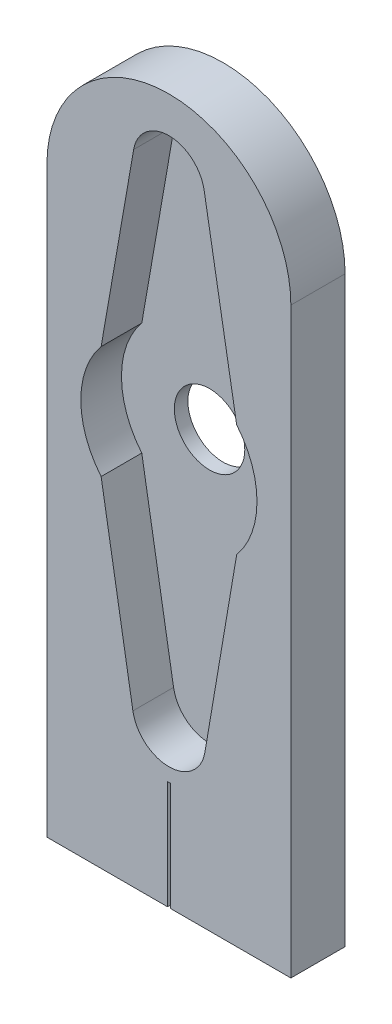
ISO-10303-21;
HEADER;
FILE_DESCRIPTION(('STEP AP214'),'2;1');
FILE_NAME('part.step','',(''),(''),'','','');
FILE_SCHEMA(('AUTOMOTIVE_DESIGN { 1 0 10303 214 1 1 1 1 }'));
ENDSEC;
DATA;
#1=APPLICATION_CONTEXT('core data for automotive mechanical design processes');
#2=APPLICATION_PROTOCOL_DEFINITION('international standard','automotive_design',2000,#1);
#3=PRODUCT_CONTEXT('',#1,'mechanical');
#4=PRODUCT('Part','Part','',(#3));
#5=PRODUCT_RELATED_PRODUCT_CATEGORY('part','',(#4));
#6=PRODUCT_DEFINITION_FORMATION('','',#4);
#7=PRODUCT_DEFINITION_CONTEXT('part definition',#1,'design');
#8=PRODUCT_DEFINITION('design','',#6,#7);
#9=PRODUCT_DEFINITION_SHAPE('','',#8);
#10=(LENGTH_UNIT() NAMED_UNIT(*) SI_UNIT(.MILLI.,.METRE.));
#11=(NAMED_UNIT(*) PLANE_ANGLE_UNIT() SI_UNIT($,.RADIAN.));
#12=(NAMED_UNIT(*) SI_UNIT($,.STERADIAN.) SOLID_ANGLE_UNIT());
#13=UNCERTAINTY_MEASURE_WITH_UNIT(LENGTH_MEASURE(1.E-05),#10,'distance_accuracy_value','');
#14=(GEOMETRIC_REPRESENTATION_CONTEXT(3) GLOBAL_UNCERTAINTY_ASSIGNED_CONTEXT((#13)) GLOBAL_UNIT_ASSIGNED_CONTEXT((#10,
#11,#12)) REPRESENTATION_CONTEXT('',''));
#15=CARTESIAN_POINT('',(0.,0.,0.));
#16=DIRECTION('',(0.,0.,1.));
#17=DIRECTION('',(1.,0.,0.));
#18=AXIS2_PLACEMENT_3D('',#15,#16,#17);
#19=CARTESIAN_POINT('',(-9.,0.,4.));
#20=DIRECTION('',(0.,1.,0.));
#21=DIRECTION('',(0.,0.,1.));
#22=AXIS2_PLACEMENT_3D('',#19,#20,#21);
#23=PLANE('',#22);
#24=DIRECTION('',(0.,0.,-1.));
#25=VECTOR('',#24,1.);
#26=CARTESIAN_POINT('',(0.1,0.,4.));
#27=LINE('',#26,#25);
#28=CARTESIAN_POINT('',(0.1,0.,4.));
#29=VERTEX_POINT('',#28);
#30=CARTESIAN_POINT('',(0.1,0.,0.));
#31=VERTEX_POINT('',#30);
#32=EDGE_CURVE('E154',#29,#31,#27,.T.);
#33=ORIENTED_EDGE('',*,*,#32,.T.);
#34=DIRECTION('',(1.,0.,0.));
#35=VECTOR('',#34,1.);
#36=CARTESIAN_POINT('',(-9.,0.,0.));
#37=LINE('',#36,#35);
#38=CARTESIAN_POINT('',(9.,0.,0.));
#39=VERTEX_POINT('',#38);
#40=EDGE_CURVE('E210',#31,#39,#37,.T.);
#41=ORIENTED_EDGE('',*,*,#40,.T.);
#42=DIRECTION('',(0.,0.,-1.));
#43=VECTOR('',#42,1.);
#44=CARTESIAN_POINT('',(9.,0.,4.));
#45=LINE('',#44,#43);
#46=CARTESIAN_POINT('',(9.,0.,4.));
#47=VERTEX_POINT('',#46);
#48=EDGE_CURVE('E11',#47,#39,#45,.T.);
#49=ORIENTED_EDGE('',*,*,#48,.F.);
#50=DIRECTION('',(1.,0.,0.));
#51=VECTOR('',#50,1.);
#52=CARTESIAN_POINT('',(-9.,0.,4.));
#53=LINE('',#52,#51);
#54=EDGE_CURVE('E170',#29,#47,#53,.T.);
#55=ORIENTED_EDGE('',*,*,#54,.F.);
#56=EDGE_LOOP('',(#33,#41,#49,#55));
#57=FACE_BOUND('',#56,.T.);
#58=ADVANCED_FACE('F38',(#57),#23,.F.);
#59=CARTESIAN_POINT('',(0.,43.,4.));
#60=DIRECTION('',(0.,0.,-1.));
#61=DIRECTION('',(-1.,0.,0.));
#62=AXIS2_PLACEMENT_3D('',#59,#60,#61);
#63=PLANE('',#62);
#64=DIRECTION('',(0.171428571428572,-0.98519655140381,0.));
#65=VECTOR('',#64,1.);
#66=CARTESIAN_POINT('',(2.6,47.145110573231,4.));
#67=LINE('',#66,#65);
#68=CARTESIAN_POINT('',(2.6,47.145110573231,4.));
#69=VERTEX_POINT('',#68);
#70=CARTESIAN_POINT('',(5.,33.3523588535777,4.));
#71=VERTEX_POINT('',#70);
#72=EDGE_CURVE('E290',#69,#71,#67,.T.);
#73=ORIENTED_EDGE('',*,*,#72,.T.);
#74=CARTESIAN_POINT('',(0.,29.1990469221187,4.));
#75=DIRECTION('',(0.,0.,1.));
#76=DIRECTION('',(1.,0.,0.));
#77=AXIS2_PLACEMENT_3D('',#74,#75,#76);
#78=CIRCLE('',#77,6.5);
#79=CARTESIAN_POINT('',(5.,25.0457349906596,4.));
#80=VERTEX_POINT('',#79);
#81=EDGE_CURVE('E63',#80,#71,#78,.T.);
#82=ORIENTED_EDGE('',*,*,#81,.F.);
#83=DIRECTION('',(-0.167405247280844,-0.985888169714415,0.));
#84=VECTOR('',#83,1.);
#85=CARTESIAN_POINT('',(5.,25.0457349906596,4.));
#86=LINE('',#85,#84);
#87=CARTESIAN_POINT('',(2.65632653806819,11.2433006146578,4.));
#88=VERTEX_POINT('',#87);
#89=EDGE_CURVE('E262',#80,#88,#86,.T.);
#90=ORIENTED_EDGE('',*,*,#89,.T.);
#91=CARTESIAN_POINT('',(0.,11.6943487300772,4.));
#92=DIRECTION('',(0.,0.,1.));
#93=DIRECTION('',(1.,0.,0.));
#94=AXIS2_PLACEMENT_3D('',#91,#92,#93);
#95=CIRCLE('',#94,2.69434873007722);
#96=CARTESIAN_POINT('',(-2.65632653806819,11.2433006146578,4.));
#97=VERTEX_POINT('',#96);
#98=EDGE_CURVE('E310',#97,#88,#95,.T.);
#99=ORIENTED_EDGE('',*,*,#98,.F.);
#100=DIRECTION('',(0.167405247280844,-0.985888169714415,0.));
#101=VECTOR('',#100,1.);
#102=CARTESIAN_POINT('',(-5.,25.0457349906596,4.));
#103=LINE('',#102,#101);
#104=CARTESIAN_POINT('',(-5.,25.0457349906596,4.));
#105=VERTEX_POINT('',#104);
#106=EDGE_CURVE('E306',#105,#97,#103,.T.);
#107=ORIENTED_EDGE('',*,*,#106,.F.);
#108=CARTESIAN_POINT('',(0.,29.1990469221187,4.));
#109=DIRECTION('',(0.,0.,1.));
#110=DIRECTION('',(1.,0.,0.));
#111=AXIS2_PLACEMENT_3D('',#108,#109,#110);
#112=CIRCLE('',#111,6.5);
#113=CARTESIAN_POINT('',(-5.,33.3523588535777,4.));
#114=VERTEX_POINT('',#113);
#115=EDGE_CURVE('E302',#114,#105,#112,.T.);
#116=ORIENTED_EDGE('',*,*,#115,.F.);
#117=DIRECTION('',(-0.171428571428572,-0.98519655140381,0.));
#118=VECTOR('',#117,1.);
#119=CARTESIAN_POINT('',(-2.6,47.145110573231,4.));
#120=LINE('',#119,#118);
#121=CARTESIAN_POINT('',(-2.6,47.145110573231,4.));
#122=VERTEX_POINT('',#121);
#123=EDGE_CURVE('E298',#122,#114,#120,.T.);
#124=ORIENTED_EDGE('',*,*,#123,.F.);
#125=CARTESIAN_POINT('',(0.,46.6926990365898,4.));
#126=DIRECTION('',(0.,0.,1.));
#127=DIRECTION('',(1.,0.,0.));
#128=AXIS2_PLACEMENT_3D('',#125,#126,#127);
#129=CIRCLE('',#128,2.63906729707413);
#130=EDGE_CURVE('E294',#69,#122,#129,.T.);
#131=ORIENTED_EDGE('',*,*,#130,.F.);
#132=EDGE_LOOP('',(#73,#82,#90,#99,#107,#116,#124,#131));
#133=FACE_BOUND('',#132,.T.);
#134=DIRECTION('',(0.,1.,0.));
#135=VECTOR('',#134,1.);
#136=CARTESIAN_POINT('',(0.1,0.,4.));
#137=LINE('',#136,#135);
#138=CARTESIAN_POINT('',(0.1,8.,4.));
#139=VERTEX_POINT('',#138);
#140=EDGE_CURVE('E157',#29,#139,#137,.T.);
#141=ORIENTED_EDGE('',*,*,#140,.F.);
#142=ORIENTED_EDGE('',*,*,#54,.T.);
#143=DIRECTION('',(0.,1.,0.));
#144=VECTOR('',#143,1.);
#145=CARTESIAN_POINT('',(9.,0.,4.));
#146=LINE('',#145,#144);
#147=CARTESIAN_POINT('',(8.99999999999999,43.,4.));
#148=VERTEX_POINT('',#147);
#149=EDGE_CURVE('E186',#47,#148,#146,.T.);
#150=ORIENTED_EDGE('',*,*,#149,.T.);
#151=CARTESIAN_POINT('',(0.,43.,4.));
#152=DIRECTION('',(0.,0.,-1.));
#153=DIRECTION('',(-1.,0.,0.));
#154=AXIS2_PLACEMENT_3D('',#151,#152,#153);
#155=CIRCLE('',#154,8.99999999999999);
#156=CARTESIAN_POINT('',(-8.99999999999999,43.,4.));
#157=VERTEX_POINT('',#156);
#158=EDGE_CURVE('E196',#157,#148,#155,.T.);
#159=ORIENTED_EDGE('',*,*,#158,.F.);
#160=DIRECTION('',(0.,1.,0.));
#161=VECTOR('',#160,1.);
#162=CARTESIAN_POINT('',(-9.,0.,4.));
#163=LINE('',#162,#161);
#164=CARTESIAN_POINT('',(-9.,0.,4.));
#165=VERTEX_POINT('',#164);
#166=EDGE_CURVE('E200',#165,#157,#163,.T.);
#167=ORIENTED_EDGE('',*,*,#166,.F.);
#168=CARTESIAN_POINT('',(-0.1,0.,4.));
#169=VERTEX_POINT('',#168);
#170=EDGE_CURVE('E180',#165,#169,#53,.T.);
#171=ORIENTED_EDGE('',*,*,#170,.T.);
#172=DIRECTION('',(0.,1.,0.));
#173=VECTOR('',#172,1.);
#174=CARTESIAN_POINT('',(-0.1,0.,4.));
#175=LINE('',#174,#173);
#176=CARTESIAN_POINT('',(-0.1,8.,4.));
#177=VERTEX_POINT('',#176);
#178=EDGE_CURVE('E239',#169,#177,#175,.T.);
#179=ORIENTED_EDGE('',*,*,#178,.T.);
#180=DIRECTION('',(1.,0.,0.));
#181=VECTOR('',#180,1.);
#182=CARTESIAN_POINT('',(-0.1,8.,4.));
#183=LINE('',#182,#181);
#184=EDGE_CURVE('E174',#177,#139,#183,.T.);
#185=ORIENTED_EDGE('',*,*,#184,.T.);
#186=EDGE_LOOP('',(#141,#142,#150,#159,#167,#171,#179,#185));
#187=FACE_BOUND('',#186,.T.);
#188=ADVANCED_FACE('F169',(#133,#187),#63,.F.);
#189=CARTESIAN_POINT('',(0.,43.,0.));
#190=DIRECTION('',(0.,0.,-1.));
#191=DIRECTION('',(-1.,0.,0.));
#192=AXIS2_PLACEMENT_3D('',#189,#190,#191);
#193=PLANE('',#192);
#194=CARTESIAN_POINT('',(0.,29.0651564973815,0.));
#195=DIRECTION('',(0.,0.,-1.));
#196=DIRECTION('',(-1.,0.,0.));
#197=AXIS2_PLACEMENT_3D('',#194,#195,#196);
#198=CIRCLE('',#197,2.6);
#199=CARTESIAN_POINT('',(-2.6,29.0651564973815,0.));
#200=VERTEX_POINT('',#199);
#201=EDGE_CURVE('E253',#200,#200,#198,.F.);
#202=ORIENTED_EDGE('',*,*,#201,.T.);
#203=EDGE_LOOP('',(#202));
#204=FACE_BOUND('',#203,.T.);
#205=ORIENTED_EDGE('',*,*,#40,.F.);
#206=DIRECTION('',(0.,1.,0.));
#207=VECTOR('',#206,1.);
#208=CARTESIAN_POINT('',(0.1,0.,0.));
#209=LINE('',#208,#207);
#210=CARTESIAN_POINT('',(0.1,8.,0.));
#211=VERTEX_POINT('',#210);
#212=EDGE_CURVE('E160',#31,#211,#209,.T.);
#213=ORIENTED_EDGE('',*,*,#212,.T.);
#214=DIRECTION('',(1.,0.,0.));
#215=VECTOR('',#214,1.);
#216=CARTESIAN_POINT('',(-0.1,8.,0.));
#217=LINE('',#216,#215);
#218=CARTESIAN_POINT('',(-0.1,8.,0.));
#219=VERTEX_POINT('',#218);
#220=EDGE_CURVE('E524',#219,#211,#217,.T.);
#221=ORIENTED_EDGE('',*,*,#220,.F.);
#222=DIRECTION('',(0.,1.,0.));
#223=VECTOR('',#222,1.);
#224=CARTESIAN_POINT('',(-0.1,0.,0.));
#225=LINE('',#224,#223);
#226=CARTESIAN_POINT('',(-0.0999999999999994,0.,0.));
#227=VERTEX_POINT('',#226);
#228=EDGE_CURVE('E176',#227,#219,#225,.T.);
#229=ORIENTED_EDGE('',*,*,#228,.F.);
#230=CARTESIAN_POINT('',(-9.,0.,0.));
#231=VERTEX_POINT('',#230);
#232=EDGE_CURVE('E205',#231,#227,#37,.T.);
#233=ORIENTED_EDGE('',*,*,#232,.F.);
#234=DIRECTION('',(0.,1.,0.));
#235=VECTOR('',#234,1.);
#236=CARTESIAN_POINT('',(-9.,0.,0.));
#237=LINE('',#236,#235);
#238=CARTESIAN_POINT('',(-8.99999999999999,43.,0.));
#239=VERTEX_POINT('',#238);
#240=EDGE_CURVE('E181',#231,#239,#237,.T.);
#241=ORIENTED_EDGE('',*,*,#240,.T.);
#242=CARTESIAN_POINT('',(0.,43.,0.));
#243=DIRECTION('',(0.,0.,-1.));
#244=DIRECTION('',(-1.,0.,0.));
#245=AXIS2_PLACEMENT_3D('',#242,#243,#244);
#246=CIRCLE('',#245,8.99999999999999);
#247=CARTESIAN_POINT('',(8.99999999999999,43.,0.));
#248=VERTEX_POINT('',#247);
#249=EDGE_CURVE('E188',#239,#248,#246,.T.);
#250=ORIENTED_EDGE('',*,*,#249,.T.);
#251=DIRECTION('',(0.,1.,0.));
#252=VECTOR('',#251,1.);
#253=CARTESIAN_POINT('',(9.,0.,0.));
#254=LINE('',#253,#252);
#255=EDGE_CURVE('E209',#39,#248,#254,.T.);
#256=ORIENTED_EDGE('',*,*,#255,.F.);
#257=EDGE_LOOP('',(#205,#213,#221,#229,#233,#241,#250,#256));
#258=FACE_BOUND('',#257,.T.);
#259=ADVANCED_FACE('F232',(#204,#258),#193,.T.);
#260=ORIENTED_EDGE('',*,*,#232,.T.);
#261=DIRECTION('',(0.,0.,-1.));
#262=VECTOR('',#261,1.);
#263=CARTESIAN_POINT('',(-0.1,0.,4.));
#264=LINE('',#263,#262);
#265=EDGE_CURVE('E55',#169,#227,#264,.T.);
#266=ORIENTED_EDGE('',*,*,#265,.F.);
#267=ORIENTED_EDGE('',*,*,#170,.F.);
#268=DIRECTION('',(0.,0.,-1.));
#269=VECTOR('',#268,1.);
#270=CARTESIAN_POINT('',(-9.,0.,4.));
#271=LINE('',#270,#269);
#272=EDGE_CURVE('E204',#165,#231,#271,.T.);
#273=ORIENTED_EDGE('',*,*,#272,.T.);
#274=EDGE_LOOP('',(#260,#266,#267,#273));
#275=FACE_BOUND('',#274,.T.);
#276=ADVANCED_FACE('F40',(#275),#23,.F.);
#277=CARTESIAN_POINT('',(9.,0.,4.));
#278=DIRECTION('',(-1.,0.,0.));
#279=DIRECTION('',(0.,-1.,0.));
#280=AXIS2_PLACEMENT_3D('',#277,#278,#279);
#281=PLANE('',#280);
#282=ORIENTED_EDGE('',*,*,#255,.T.);
#283=DIRECTION('',(0.,0.,-1.));
#284=VECTOR('',#283,1.);
#285=CARTESIAN_POINT('',(8.99999999999999,43.,4.));
#286=LINE('',#285,#284);
#287=EDGE_CURVE('E48',#148,#248,#286,.T.);
#288=ORIENTED_EDGE('',*,*,#287,.F.);
#289=ORIENTED_EDGE('',*,*,#149,.F.);
#290=ORIENTED_EDGE('',*,*,#48,.T.);
#291=EDGE_LOOP('',(#282,#288,#289,#290));
#292=FACE_BOUND('',#291,.T.);
#293=ADVANCED_FACE('F230',(#292),#281,.F.);
#294=CARTESIAN_POINT('',(0.,43.,4.));
#295=DIRECTION('',(0.,0.,-1.));
#296=DIRECTION('',(-1.,0.,0.));
#297=AXIS2_PLACEMENT_3D('',#294,#295,#296);
#298=CYLINDRICAL_SURFACE('',#297,8.99999999999999);
#299=ORIENTED_EDGE('',*,*,#249,.F.);
#300=DIRECTION('',(0.,0.,-1.));
#301=VECTOR('',#300,1.);
#302=CARTESIAN_POINT('',(-8.99999999999999,43.,4.));
#303=LINE('',#302,#301);
#304=EDGE_CURVE('E219',#157,#239,#303,.T.);
#305=ORIENTED_EDGE('',*,*,#304,.F.);
#306=ORIENTED_EDGE('',*,*,#158,.T.);
#307=ORIENTED_EDGE('',*,*,#287,.T.);
#308=EDGE_LOOP('',(#299,#305,#306,#307));
#309=FACE_BOUND('',#308,.T.);
#310=ADVANCED_FACE('F226',(#309),#298,.T.);
#311=CARTESIAN_POINT('',(-9.,0.,4.));
#312=DIRECTION('',(-1.,0.,0.));
#313=DIRECTION('',(0.,-1.,0.));
#314=AXIS2_PLACEMENT_3D('',#311,#312,#313);
#315=PLANE('',#314);
#316=ORIENTED_EDGE('',*,*,#240,.F.);
#317=ORIENTED_EDGE('',*,*,#272,.F.);
#318=ORIENTED_EDGE('',*,*,#166,.T.);
#319=ORIENTED_EDGE('',*,*,#304,.T.);
#320=EDGE_LOOP('',(#316,#317,#318,#319));
#321=FACE_BOUND('',#320,.T.);
#322=ADVANCED_FACE('F236',(#321),#315,.T.);
#323=CARTESIAN_POINT('',(0.,29.1990469221187,1.));
#324=DIRECTION('',(0.,0.,1.));
#325=DIRECTION('',(1.,0.,0.));
#326=AXIS2_PLACEMENT_3D('',#323,#324,#325);
#327=CYLINDRICAL_SURFACE('',#326,6.5);
#328=ORIENTED_EDGE('',*,*,#81,.T.);
#329=DIRECTION('',(0.,0.,1.));
#330=VECTOR('',#329,1.);
#331=CARTESIAN_POINT('',(5.,33.3523588535777,1.));
#332=LINE('',#331,#330);
#333=CARTESIAN_POINT('',(5.,33.3523588535777,1.));
#334=VERTEX_POINT('',#333);
#335=EDGE_CURVE('E192',#334,#71,#332,.T.);
#336=ORIENTED_EDGE('',*,*,#335,.F.);
#337=CARTESIAN_POINT('',(0.,29.1990469221187,1.));
#338=DIRECTION('',(0.,0.,1.));
#339=DIRECTION('',(1.,0.,0.));
#340=AXIS2_PLACEMENT_3D('',#337,#338,#339);
#341=CIRCLE('',#340,6.5);
#342=CARTESIAN_POINT('',(5.,25.0457349906596,1.));
#343=VERTEX_POINT('',#342);
#344=EDGE_CURVE('E257',#343,#334,#341,.T.);
#345=ORIENTED_EDGE('',*,*,#344,.F.);
#346=DIRECTION('',(0.,0.,1.));
#347=VECTOR('',#346,1.);
#348=CARTESIAN_POINT('',(5.,25.0457349906596,1.));
#349=LINE('',#348,#347);
#350=EDGE_CURVE('E317',#343,#80,#349,.T.);
#351=ORIENTED_EDGE('',*,*,#350,.T.);
#352=EDGE_LOOP('',(#328,#336,#345,#351));
#353=FACE_BOUND('',#352,.T.);
#354=ADVANCED_FACE('F356',(#353),#327,.F.);
#355=CARTESIAN_POINT('',(5.,25.0457349906596,1.));
#356=DIRECTION('',(-0.985888169714415,0.167405247280844,0.));
#357=DIRECTION('',(-0.167405247280844,-0.985888169714415,0.));
#358=AXIS2_PLACEMENT_3D('',#355,#356,#357);
#359=PLANE('',#358);
#360=ORIENTED_EDGE('',*,*,#89,.F.);
#361=ORIENTED_EDGE('',*,*,#350,.F.);
#362=DIRECTION('',(-0.167405247280844,-0.985888169714415,0.));
#363=VECTOR('',#362,1.);
#364=CARTESIAN_POINT('',(5.,25.0457349906596,1.));
#365=LINE('',#364,#363);
#366=CARTESIAN_POINT('',(2.65632653806819,11.2433006146578,1.));
#367=VERTEX_POINT('',#366);
#368=EDGE_CURVE('E285',#343,#367,#365,.T.);
#369=ORIENTED_EDGE('',*,*,#368,.T.);
#370=DIRECTION('',(0.,0.,1.));
#371=VECTOR('',#370,1.);
#372=CARTESIAN_POINT('',(2.65632653806819,11.2433006146578,1.));
#373=LINE('',#372,#371);
#374=EDGE_CURVE('E320',#367,#88,#373,.T.);
#375=ORIENTED_EDGE('',*,*,#374,.T.);
#376=EDGE_LOOP('',(#360,#361,#369,#375));
#377=FACE_BOUND('',#376,.T.);
#378=ADVANCED_FACE('F359',(#377),#359,.T.);
#379=CARTESIAN_POINT('',(0.,11.6943487300772,1.));
#380=DIRECTION('',(0.,0.,1.));
#381=DIRECTION('',(1.,0.,0.));
#382=AXIS2_PLACEMENT_3D('',#379,#380,#381);
#383=CYLINDRICAL_SURFACE('',#382,2.69434873007722);
#384=ORIENTED_EDGE('',*,*,#98,.T.);
#385=ORIENTED_EDGE('',*,*,#374,.F.);
#386=CARTESIAN_POINT('',(0.,11.6943487300772,1.));
#387=DIRECTION('',(0.,0.,1.));
#388=DIRECTION('',(1.,0.,0.));
#389=AXIS2_PLACEMENT_3D('',#386,#387,#388);
#390=CIRCLE('',#389,2.69434873007722);
#391=CARTESIAN_POINT('',(-2.65632653806819,11.2433006146578,1.));
#392=VERTEX_POINT('',#391);
#393=EDGE_CURVE('E281',#392,#367,#390,.T.);
#394=ORIENTED_EDGE('',*,*,#393,.F.);
#395=DIRECTION('',(0.,0.,1.));
#396=VECTOR('',#395,1.);
#397=CARTESIAN_POINT('',(-2.65632653806819,11.2433006146578,1.));
#398=LINE('',#397,#396);
#399=EDGE_CURVE('E323',#392,#97,#398,.T.);
#400=ORIENTED_EDGE('',*,*,#399,.T.);
#401=EDGE_LOOP('',(#384,#385,#394,#400));
#402=FACE_BOUND('',#401,.T.);
#403=ADVANCED_FACE('F364',(#402),#383,.F.);
#404=CARTESIAN_POINT('',(-5.,25.0457349906596,1.));
#405=DIRECTION('',(-0.985888169714415,-0.167405247280844,0.));
#406=DIRECTION('',(0.167405247280844,-0.985888169714415,0.));
#407=AXIS2_PLACEMENT_3D('',#404,#405,#406);
#408=PLANE('',#407);
#409=ORIENTED_EDGE('',*,*,#106,.T.);
#410=ORIENTED_EDGE('',*,*,#399,.F.);
#411=DIRECTION('',(0.167405247280844,-0.985888169714415,0.));
#412=VECTOR('',#411,1.);
#413=CARTESIAN_POINT('',(-5.,25.0457349906596,1.));
#414=LINE('',#413,#412);
#415=CARTESIAN_POINT('',(-5.,25.0457349906596,1.));
#416=VERTEX_POINT('',#415);
#417=EDGE_CURVE('E277',#416,#392,#414,.T.);
#418=ORIENTED_EDGE('',*,*,#417,.F.);
#419=DIRECTION('',(0.,0.,1.));
#420=VECTOR('',#419,1.);
#421=CARTESIAN_POINT('',(-5.,25.0457349906596,1.));
#422=LINE('',#421,#420);
#423=EDGE_CURVE('E326',#416,#105,#422,.T.);
#424=ORIENTED_EDGE('',*,*,#423,.T.);
#425=EDGE_LOOP('',(#409,#410,#418,#424));
#426=FACE_BOUND('',#425,.T.);
#427=ADVANCED_FACE('F368',(#426),#408,.F.);
#428=CARTESIAN_POINT('',(0.,29.1990469221187,1.));
#429=DIRECTION('',(0.,0.,1.));
#430=DIRECTION('',(1.,0.,0.));
#431=AXIS2_PLACEMENT_3D('',#428,#429,#430);
#432=CYLINDRICAL_SURFACE('',#431,6.5);
#433=ORIENTED_EDGE('',*,*,#115,.T.);
#434=ORIENTED_EDGE('',*,*,#423,.F.);
#435=CARTESIAN_POINT('',(0.,29.1990469221187,1.));
#436=DIRECTION('',(0.,0.,1.));
#437=DIRECTION('',(1.,0.,0.));
#438=AXIS2_PLACEMENT_3D('',#435,#436,#437);
#439=CIRCLE('',#438,6.5);
#440=CARTESIAN_POINT('',(-5.,33.3523588535777,1.));
#441=VERTEX_POINT('',#440);
#442=EDGE_CURVE('E273',#441,#416,#439,.T.);
#443=ORIENTED_EDGE('',*,*,#442,.F.);
#444=DIRECTION('',(0.,0.,1.));
#445=VECTOR('',#444,1.);
#446=CARTESIAN_POINT('',(-5.,33.3523588535777,1.));
#447=LINE('',#446,#445);
#448=EDGE_CURVE('E329',#441,#114,#447,.T.);
#449=ORIENTED_EDGE('',*,*,#448,.T.);
#450=EDGE_LOOP('',(#433,#434,#443,#449));
#451=FACE_BOUND('',#450,.T.);
#452=ADVANCED_FACE('F370',(#451),#432,.F.);
#453=CARTESIAN_POINT('',(-2.6,47.145110573231,1.));
#454=DIRECTION('',(-0.985196551403809,0.171428571428572,0.));
#455=DIRECTION('',(-0.171428571428572,-0.98519655140381,0.));
#456=AXIS2_PLACEMENT_3D('',#453,#454,#455);
#457=PLANE('',#456);
#458=ORIENTED_EDGE('',*,*,#123,.T.);
#459=ORIENTED_EDGE('',*,*,#448,.F.);
#460=DIRECTION('',(-0.171428571428572,-0.98519655140381,0.));
#461=VECTOR('',#460,1.);
#462=CARTESIAN_POINT('',(-2.6,47.145110573231,1.));
#463=LINE('',#462,#461);
#464=CARTESIAN_POINT('',(-2.6,47.145110573231,1.));
#465=VERTEX_POINT('',#464);
#466=EDGE_CURVE('E269',#465,#441,#463,.T.);
#467=ORIENTED_EDGE('',*,*,#466,.F.);
#468=DIRECTION('',(0.,0.,1.));
#469=VECTOR('',#468,1.);
#470=CARTESIAN_POINT('',(-2.6,47.145110573231,1.));
#471=LINE('',#470,#469);
#472=EDGE_CURVE('E332',#465,#122,#471,.T.);
#473=ORIENTED_EDGE('',*,*,#472,.T.);
#474=EDGE_LOOP('',(#458,#459,#467,#473));
#475=FACE_BOUND('',#474,.T.);
#476=ADVANCED_FACE('F351',(#475),#457,.F.);
#477=CARTESIAN_POINT('',(0.,46.6926990365898,1.));
#478=DIRECTION('',(0.,0.,1.));
#479=DIRECTION('',(1.,0.,0.));
#480=AXIS2_PLACEMENT_3D('',#477,#478,#479);
#481=CYLINDRICAL_SURFACE('',#480,2.63906729707413);
#482=ORIENTED_EDGE('',*,*,#130,.T.);
#483=ORIENTED_EDGE('',*,*,#472,.F.);
#484=CARTESIAN_POINT('',(0.,46.6926990365898,1.));
#485=DIRECTION('',(0.,0.,1.));
#486=DIRECTION('',(1.,0.,0.));
#487=AXIS2_PLACEMENT_3D('',#484,#485,#486);
#488=CIRCLE('',#487,2.63906729707413);
#489=CARTESIAN_POINT('',(2.6,47.145110573231,1.));
#490=VERTEX_POINT('',#489);
#491=EDGE_CURVE('E265',#490,#465,#488,.T.);
#492=ORIENTED_EDGE('',*,*,#491,.F.);
#493=DIRECTION('',(0.,0.,1.));
#494=VECTOR('',#493,1.);
#495=CARTESIAN_POINT('',(2.6,47.145110573231,1.));
#496=LINE('',#495,#494);
#497=EDGE_CURVE('E334',#490,#69,#496,.T.);
#498=ORIENTED_EDGE('',*,*,#497,.T.);
#499=EDGE_LOOP('',(#482,#483,#492,#498));
#500=FACE_BOUND('',#499,.T.);
#501=ADVANCED_FACE('F348',(#500),#481,.F.);
#502=CARTESIAN_POINT('',(2.6,47.145110573231,1.));
#503=DIRECTION('',(-0.985196551403809,-0.171428571428572,0.));
#504=DIRECTION('',(0.171428571428572,-0.98519655140381,0.));
#505=AXIS2_PLACEMENT_3D('',#502,#503,#504);
#506=PLANE('',#505);
#507=ORIENTED_EDGE('',*,*,#72,.F.);
#508=ORIENTED_EDGE('',*,*,#497,.F.);
#509=DIRECTION('',(0.171428571428572,-0.98519655140381,0.));
#510=VECTOR('',#509,1.);
#511=CARTESIAN_POINT('',(2.6,47.145110573231,1.));
#512=LINE('',#511,#510);
#513=EDGE_CURVE('E261',#490,#334,#512,.T.);
#514=ORIENTED_EDGE('',*,*,#513,.T.);
#515=ORIENTED_EDGE('',*,*,#335,.T.);
#516=EDGE_LOOP('',(#507,#508,#514,#515));
#517=FACE_BOUND('',#516,.T.);
#518=ADVANCED_FACE('F341',(#517),#506,.T.);
#519=CARTESIAN_POINT('',(0.,29.1990469221187,1.));
#520=DIRECTION('',(0.,0.,1.));
#521=DIRECTION('',(1.,0.,0.));
#522=AXIS2_PLACEMENT_3D('',#519,#520,#521);
#523=PLANE('',#522);
#524=CARTESIAN_POINT('',(0.,29.0651564973815,1.));
#525=DIRECTION('',(0.,0.,1.));
#526=DIRECTION('',(1.,0.,0.));
#527=AXIS2_PLACEMENT_3D('',#524,#525,#526);
#528=CIRCLE('',#527,2.6);
#529=CARTESIAN_POINT('',(2.6,29.0651564973815,1.));
#530=VERTEX_POINT('',#529);
#531=EDGE_CURVE('E42',#530,#530,#528,.F.);
#532=ORIENTED_EDGE('',*,*,#531,.T.);
#533=EDGE_LOOP('',(#532));
#534=FACE_BOUND('',#533,.T.);
#535=ORIENTED_EDGE('',*,*,#344,.T.);
#536=ORIENTED_EDGE('',*,*,#513,.F.);
#537=ORIENTED_EDGE('',*,*,#491,.T.);
#538=ORIENTED_EDGE('',*,*,#466,.T.);
#539=ORIENTED_EDGE('',*,*,#442,.T.);
#540=ORIENTED_EDGE('',*,*,#417,.T.);
#541=ORIENTED_EDGE('',*,*,#393,.T.);
#542=ORIENTED_EDGE('',*,*,#368,.F.);
#543=EDGE_LOOP('',(#535,#536,#537,#538,#539,#540,#541,#542));
#544=FACE_BOUND('',#543,.T.);
#545=ADVANCED_FACE('F354',(#534,#544),#523,.T.);
#546=CARTESIAN_POINT('',(0.,29.0651564973815,19.));
#547=DIRECTION('',(0.,0.,-1.));
#548=DIRECTION('',(-1.,0.,0.));
#549=AXIS2_PLACEMENT_3D('',#546,#547,#548);
#550=CYLINDRICAL_SURFACE('',#549,2.6);
#551=ORIENTED_EDGE('',*,*,#201,.F.);
#552=EDGE_LOOP('',(#551));
#553=FACE_BOUND('',#552,.T.);
#554=ORIENTED_EDGE('',*,*,#531,.F.);
#555=EDGE_LOOP('',(#554));
#556=FACE_BOUND('',#555,.T.);
#557=ADVANCED_FACE('F462',(#553,#556),#550,.F.);
#558=CARTESIAN_POINT('',(0.1,0.,4.));
#559=DIRECTION('',(-1.,0.,0.));
#560=DIRECTION('',(0.,0.,1.));
#561=AXIS2_PLACEMENT_3D('',#558,#559,#560);
#562=PLANE('',#561);
#563=ORIENTED_EDGE('',*,*,#212,.F.);
#564=ORIENTED_EDGE('',*,*,#32,.F.);
#565=ORIENTED_EDGE('',*,*,#140,.T.);
#566=DIRECTION('',(0.,0.,-1.));
#567=VECTOR('',#566,1.);
#568=CARTESIAN_POINT('',(0.1,8.,4.));
#569=LINE('',#568,#567);
#570=EDGE_CURVE('E165',#139,#211,#569,.T.);
#571=ORIENTED_EDGE('',*,*,#570,.T.);
#572=EDGE_LOOP('',(#563,#564,#565,#571));
#573=FACE_BOUND('',#572,.T.);
#574=ADVANCED_FACE('F156',(#573),#562,.T.);
#575=CARTESIAN_POINT('',(-0.1,8.,4.));
#576=DIRECTION('',(0.,1.,0.));
#577=DIRECTION('',(0.,0.,1.));
#578=AXIS2_PLACEMENT_3D('',#575,#576,#577);
#579=PLANE('',#578);
#580=ORIENTED_EDGE('',*,*,#220,.T.);
#581=ORIENTED_EDGE('',*,*,#570,.F.);
#582=ORIENTED_EDGE('',*,*,#184,.F.);
#583=DIRECTION('',(0.,0.,-1.));
#584=VECTOR('',#583,1.);
#585=CARTESIAN_POINT('',(-0.1,8.,4.));
#586=LINE('',#585,#584);
#587=EDGE_CURVE('E242',#177,#219,#586,.T.);
#588=ORIENTED_EDGE('',*,*,#587,.T.);
#589=EDGE_LOOP('',(#580,#581,#582,#588));
#590=FACE_BOUND('',#589,.T.);
#591=ADVANCED_FACE('F500',(#590),#579,.F.);
#592=CARTESIAN_POINT('',(-0.1,0.,4.));
#593=DIRECTION('',(-1.,0.,0.));
#594=DIRECTION('',(0.,0.,1.));
#595=AXIS2_PLACEMENT_3D('',#592,#593,#594);
#596=PLANE('',#595);
#597=ORIENTED_EDGE('',*,*,#228,.T.);
#598=ORIENTED_EDGE('',*,*,#587,.F.);
#599=ORIENTED_EDGE('',*,*,#178,.F.);
#600=ORIENTED_EDGE('',*,*,#265,.T.);
#601=EDGE_LOOP('',(#597,#598,#599,#600));
#602=FACE_BOUND('',#601,.T.);
#603=ADVANCED_FACE('F509',(#602),#596,.F.);
#604=CLOSED_SHELL('',(#58,#188,#259,#276,#293,#310,#322,#354,#378,#403,#427,#452,#476,#501,#518,
#545,#557,#574,#591,#603));
#605=MANIFOLD_SOLID_BREP('B2',#604);
#606=ADVANCED_BREP_SHAPE_REPRESENTATION('',(#18,#605),#14);
#607=SHAPE_DEFINITION_REPRESENTATION(#9,#606);
ENDSEC;
END-ISO-10303-21;
